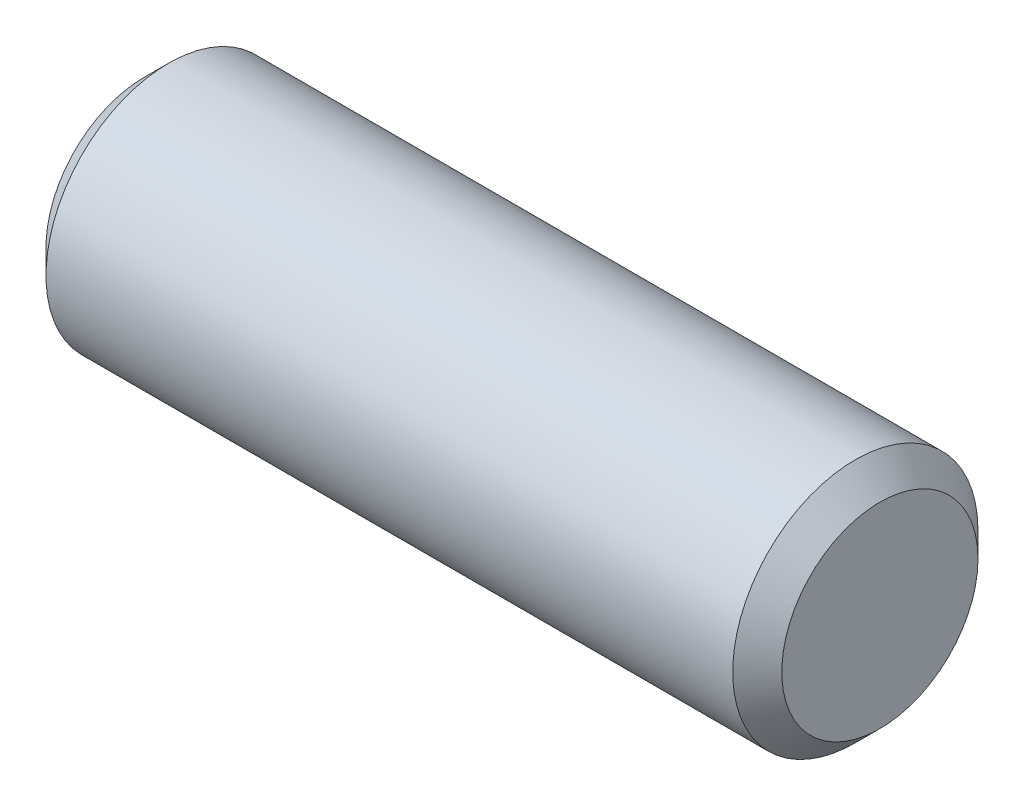
ISO-10303-21;
HEADER;
FILE_DESCRIPTION(('STEP AP214'),'2;1');
FILE_NAME('part.step','',(''),(''),'','','');
FILE_SCHEMA(('AUTOMOTIVE_DESIGN { 1 0 10303 214 1 1 1 1 }'));
ENDSEC;
DATA;
#1=APPLICATION_CONTEXT('core data for automotive mechanical design processes');
#2=APPLICATION_PROTOCOL_DEFINITION('international standard','automotive_design',2000,#1);
#3=PRODUCT_CONTEXT('',#1,'mechanical');
#4=PRODUCT('Part','Part','',(#3));
#5=PRODUCT_RELATED_PRODUCT_CATEGORY('part','',(#4));
#6=PRODUCT_DEFINITION_FORMATION('','',#4);
#7=PRODUCT_DEFINITION_CONTEXT('part definition',#1,'design');
#8=PRODUCT_DEFINITION('design','',#6,#7);
#9=PRODUCT_DEFINITION_SHAPE('','',#8);
#10=(LENGTH_UNIT() NAMED_UNIT(*) SI_UNIT(.MILLI.,.METRE.));
#11=(NAMED_UNIT(*) PLANE_ANGLE_UNIT() SI_UNIT($,.RADIAN.));
#12=(NAMED_UNIT(*) SI_UNIT($,.STERADIAN.) SOLID_ANGLE_UNIT());
#13=UNCERTAINTY_MEASURE_WITH_UNIT(LENGTH_MEASURE(1.E-05),#10,'distance_accuracy_value','');
#14=(GEOMETRIC_REPRESENTATION_CONTEXT(3) GLOBAL_UNCERTAINTY_ASSIGNED_CONTEXT((#13)) GLOBAL_UNIT_ASSIGNED_CONTEXT((#10,
#11,#12)) REPRESENTATION_CONTEXT('',''));
#15=CARTESIAN_POINT('',(0.,0.,0.));
#16=DIRECTION('',(0.,0.,1.));
#17=DIRECTION('',(1.,0.,0.));
#18=AXIS2_PLACEMENT_3D('',#15,#16,#17);
#19=CARTESIAN_POINT('',(-4.7625,0.,0.));
#20=DIRECTION('',(1.,0.,0.));
#21=DIRECTION('',(0.,0.,-1.));
#22=AXIS2_PLACEMENT_3D('',#19,#20,#21);
#23=CYLINDRICAL_SURFACE('',#22,1.5875);
#24=CARTESIAN_POINT('',(4.445,0.,0.));
#25=DIRECTION('',(1.,0.,0.));
#26=DIRECTION('',(0.,0.,-1.));
#27=AXIS2_PLACEMENT_3D('',#24,#25,#26);
#28=CIRCLE('',#27,1.5875);
#29=CARTESIAN_POINT('',(4.445,0.,-1.5875));
#30=VERTEX_POINT('',#29);
#31=EDGE_CURVE('E44',#30,#30,#28,.F.);
#32=ORIENTED_EDGE('',*,*,#31,.T.);
#33=EDGE_LOOP('',(#32));
#34=FACE_BOUND('',#33,.T.);
#35=CARTESIAN_POINT('',(-4.445,0.,0.));
#36=DIRECTION('',(1.,0.,0.));
#37=DIRECTION('',(0.,0.,-1.));
#38=AXIS2_PLACEMENT_3D('',#35,#36,#37);
#39=CIRCLE('',#38,1.5875);
#40=CARTESIAN_POINT('',(-4.445,0.,-1.5875));
#41=VERTEX_POINT('',#40);
#42=EDGE_CURVE('E50',#41,#41,#39,.T.);
#43=ORIENTED_EDGE('',*,*,#42,.T.);
#44=EDGE_LOOP('',(#43));
#45=FACE_BOUND('',#44,.T.);
#46=ADVANCED_FACE('F36',(#34,#45),#23,.T.);
#47=CARTESIAN_POINT('',(-4.7625,0.,0.));
#48=DIRECTION('',(1.,0.,0.));
#49=DIRECTION('',(0.,0.,-1.));
#50=AXIS2_PLACEMENT_3D('',#47,#48,#49);
#51=PLANE('',#50);
#52=CARTESIAN_POINT('',(-4.7625,0.,0.));
#53=DIRECTION('',(1.,0.,0.));
#54=DIRECTION('',(0.,0.,-1.));
#55=AXIS2_PLACEMENT_3D('',#52,#53,#54);
#56=CIRCLE('',#55,1.27);
#57=CARTESIAN_POINT('',(-4.7625,0.,-1.27));
#58=VERTEX_POINT('',#57);
#59=EDGE_CURVE('E10',#58,#58,#56,.F.);
#60=ORIENTED_EDGE('',*,*,#59,.T.);
#61=EDGE_LOOP('',(#60));
#62=FACE_BOUND('',#61,.T.);
#63=ADVANCED_FACE('F71',(#62),#51,.F.);
#64=CARTESIAN_POINT('',(4.7625,0.,0.));
#65=DIRECTION('',(1.,0.,0.));
#66=DIRECTION('',(0.,0.,-1.));
#67=AXIS2_PLACEMENT_3D('',#64,#65,#66);
#68=PLANE('',#67);
#69=CARTESIAN_POINT('',(4.7625,0.,0.));
#70=DIRECTION('',(1.,0.,0.));
#71=DIRECTION('',(0.,0.,-1.));
#72=AXIS2_PLACEMENT_3D('',#69,#70,#71);
#73=CIRCLE('',#72,1.27);
#74=CARTESIAN_POINT('',(4.7625,0.,-1.27));
#75=VERTEX_POINT('',#74);
#76=EDGE_CURVE('E55',#75,#75,#73,.T.);
#77=ORIENTED_EDGE('',*,*,#76,.T.);
#78=EDGE_LOOP('',(#77));
#79=FACE_BOUND('',#78,.T.);
#80=ADVANCED_FACE('F61',(#79),#68,.T.);
#81=CARTESIAN_POINT('',(4.7625,0.,0.));
#82=DIRECTION('',(-1.,0.,0.));
#83=DIRECTION('',(0.,0.,1.));
#84=AXIS2_PLACEMENT_3D('',#81,#82,#83);
#85=CONICAL_SURFACE('',#84,1.27,0.785398163397446);
#86=ORIENTED_EDGE('',*,*,#31,.F.);
#87=EDGE_LOOP('',(#86));
#88=FACE_BOUND('',#87,.T.);
#89=ORIENTED_EDGE('',*,*,#76,.F.);
#90=EDGE_LOOP('',(#89));
#91=FACE_BOUND('',#90,.T.);
#92=ADVANCED_FACE('F63',(#88,#91),#85,.T.);
#93=CARTESIAN_POINT('',(-4.445,0.,0.));
#94=DIRECTION('',(1.,0.,0.));
#95=DIRECTION('',(0.,0.,-1.));
#96=AXIS2_PLACEMENT_3D('',#93,#94,#95);
#97=CONICAL_SURFACE('',#96,1.5875,0.78539816339745);
#98=ORIENTED_EDGE('',*,*,#59,.F.);
#99=EDGE_LOOP('',(#98));
#100=FACE_BOUND('',#99,.T.);
#101=ORIENTED_EDGE('',*,*,#42,.F.);
#102=EDGE_LOOP('',(#101));
#103=FACE_BOUND('',#102,.T.);
#104=ADVANCED_FACE('F38',(#100,#103),#97,.T.);
#105=CLOSED_SHELL('',(#46,#63,#80,#92,#104));
#106=MANIFOLD_SOLID_BREP('B2',#105);
#107=ADVANCED_BREP_SHAPE_REPRESENTATION('',(#18,#106),#14);
#108=SHAPE_DEFINITION_REPRESENTATION(#9,#107);
ENDSEC;
END-ISO-10303-21;
